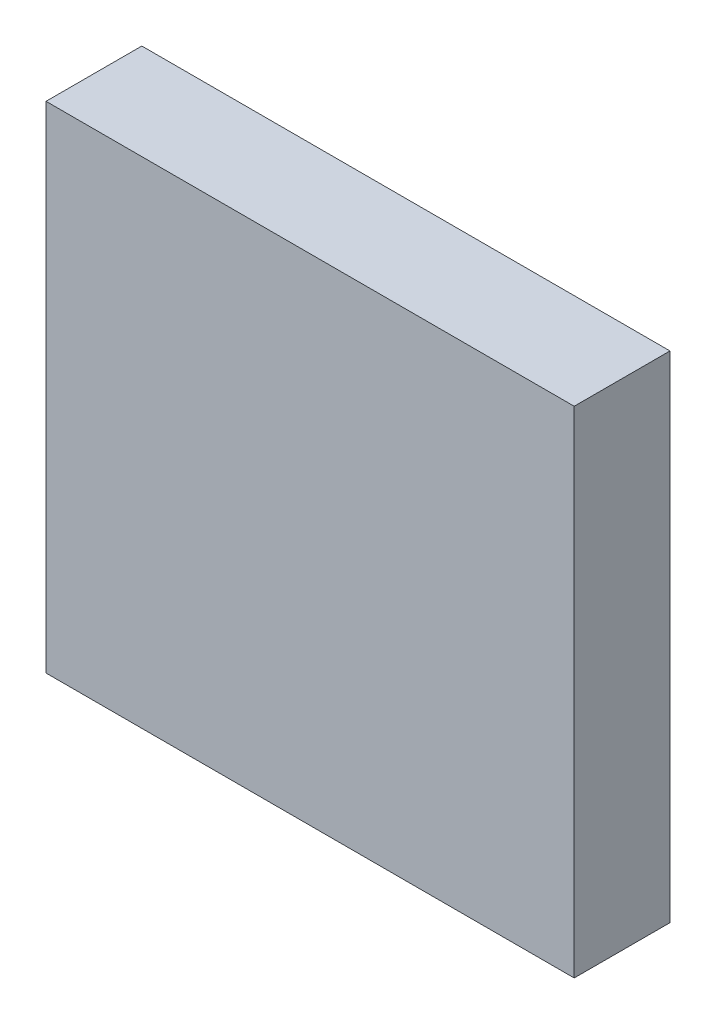
ISO-10303-21;
HEADER;
FILE_DESCRIPTION(('STEP AP214'),'2;1');
FILE_NAME('part.step','',(''),(''),'','','');
FILE_SCHEMA(('AUTOMOTIVE_DESIGN { 1 0 10303 214 1 1 1 1 }'));
ENDSEC;
DATA;
#1=APPLICATION_CONTEXT('core data for automotive mechanical design processes');
#2=APPLICATION_PROTOCOL_DEFINITION('international standard','automotive_design',2000,#1);
#3=PRODUCT_CONTEXT('',#1,'mechanical');
#4=PRODUCT('Part','Part','',(#3));
#5=PRODUCT_RELATED_PRODUCT_CATEGORY('part','',(#4));
#6=PRODUCT_DEFINITION_FORMATION('','',#4);
#7=PRODUCT_DEFINITION_CONTEXT('part definition',#1,'design');
#8=PRODUCT_DEFINITION('design','',#6,#7);
#9=PRODUCT_DEFINITION_SHAPE('','',#8);
#10=(LENGTH_UNIT() NAMED_UNIT(*) SI_UNIT(.MILLI.,.METRE.));
#11=(NAMED_UNIT(*) PLANE_ANGLE_UNIT() SI_UNIT($,.RADIAN.));
#12=(NAMED_UNIT(*) SI_UNIT($,.STERADIAN.) SOLID_ANGLE_UNIT());
#13=UNCERTAINTY_MEASURE_WITH_UNIT(LENGTH_MEASURE(1.E-05),#10,'distance_accuracy_value','');
#14=(GEOMETRIC_REPRESENTATION_CONTEXT(3) GLOBAL_UNCERTAINTY_ASSIGNED_CONTEXT((#13)) GLOBAL_UNIT_ASSIGNED_CONTEXT((#10,
#11,#12)) REPRESENTATION_CONTEXT('',''));
#15=CARTESIAN_POINT('',(0.,0.,0.));
#16=DIRECTION('',(0.,0.,1.));
#17=DIRECTION('',(1.,0.,0.));
#18=AXIS2_PLACEMENT_3D('',#15,#16,#17);
#19=CARTESIAN_POINT('',(0.,0.,17.41));
#20=DIRECTION('',(0.,1.,0.));
#21=DIRECTION('',(0.,0.,1.));
#22=AXIS2_PLACEMENT_3D('',#19,#20,#21);
#23=PLANE('',#22);
#24=DIRECTION('',(1.,0.,0.));
#25=VECTOR('',#24,1.);
#26=CARTESIAN_POINT('',(0.,0.,0.));
#27=LINE('',#26,#25);
#28=CARTESIAN_POINT('',(-96.,0.,0.));
#29=VERTEX_POINT('',#28);
#30=CARTESIAN_POINT('',(0.,0.,0.));
#31=VERTEX_POINT('',#30);
#32=EDGE_CURVE('E113',#29,#31,#27,.T.);
#33=ORIENTED_EDGE('',*,*,#32,.T.);
#34=DIRECTION('',(0.,0.,-1.));
#35=VECTOR('',#34,1.);
#36=CARTESIAN_POINT('',(0.,0.,17.41));
#37=LINE('',#36,#35);
#38=CARTESIAN_POINT('',(0.,0.,17.41));
#39=VERTEX_POINT('',#38);
#40=EDGE_CURVE('E11',#39,#31,#37,.T.);
#41=ORIENTED_EDGE('',*,*,#40,.F.);
#42=DIRECTION('',(1.,0.,0.));
#43=VECTOR('',#42,1.);
#44=CARTESIAN_POINT('',(0.,0.,17.41));
#45=LINE('',#44,#43);
#46=CARTESIAN_POINT('',(-96.,0.,17.41));
#47=VERTEX_POINT('',#46);
#48=EDGE_CURVE('E97',#47,#39,#45,.T.);
#49=ORIENTED_EDGE('',*,*,#48,.F.);
#50=DIRECTION('',(0.,0.,-1.));
#51=VECTOR('',#50,1.);
#52=CARTESIAN_POINT('',(-96.,0.,17.41));
#53=LINE('',#52,#51);
#54=EDGE_CURVE('E109',#47,#29,#53,.T.);
#55=ORIENTED_EDGE('',*,*,#54,.T.);
#56=EDGE_LOOP('',(#33,#41,#49,#55));
#57=FACE_BOUND('',#56,.T.);
#58=ADVANCED_FACE('F45',(#57),#23,.F.);
#59=CARTESIAN_POINT('',(0.,0.,17.41));
#60=DIRECTION('',(-1.,0.,0.));
#61=DIRECTION('',(0.,0.,1.));
#62=AXIS2_PLACEMENT_3D('',#59,#60,#61);
#63=PLANE('',#62);
#64=DIRECTION('',(0.,1.,0.));
#65=VECTOR('',#64,1.);
#66=CARTESIAN_POINT('',(0.,0.,0.));
#67=LINE('',#66,#65);
#68=CARTESIAN_POINT('',(0.,90.,0.));
#69=VERTEX_POINT('',#68);
#70=EDGE_CURVE('E102',#31,#69,#67,.T.);
#71=ORIENTED_EDGE('',*,*,#70,.T.);
#72=DIRECTION('',(0.,0.,-1.));
#73=VECTOR('',#72,1.);
#74=CARTESIAN_POINT('',(0.,90.,17.41));
#75=LINE('',#74,#73);
#76=CARTESIAN_POINT('',(0.,90.,17.41));
#77=VERTEX_POINT('',#76);
#78=EDGE_CURVE('E54',#77,#69,#75,.T.);
#79=ORIENTED_EDGE('',*,*,#78,.F.);
#80=DIRECTION('',(0.,1.,0.));
#81=VECTOR('',#80,1.);
#82=CARTESIAN_POINT('',(0.,0.,17.41));
#83=LINE('',#82,#81);
#84=EDGE_CURVE('E92',#39,#77,#83,.T.);
#85=ORIENTED_EDGE('',*,*,#84,.F.);
#86=ORIENTED_EDGE('',*,*,#40,.T.);
#87=EDGE_LOOP('',(#71,#79,#85,#86));
#88=FACE_BOUND('',#87,.T.);
#89=ADVANCED_FACE('F101',(#88),#63,.F.);
#90=CARTESIAN_POINT('',(0.,90.,17.41));
#91=DIRECTION('',(0.,-1.,0.));
#92=DIRECTION('',(0.,0.,-1.));
#93=AXIS2_PLACEMENT_3D('',#90,#91,#92);
#94=PLANE('',#93);
#95=DIRECTION('',(-1.,0.,0.));
#96=VECTOR('',#95,1.);
#97=CARTESIAN_POINT('',(0.,90.,0.));
#98=LINE('',#97,#96);
#99=CARTESIAN_POINT('',(-96.,90.,0.));
#100=VERTEX_POINT('',#99);
#101=EDGE_CURVE('E79',#69,#100,#98,.T.);
#102=ORIENTED_EDGE('',*,*,#101,.T.);
#103=DIRECTION('',(0.,0.,-1.));
#104=VECTOR('',#103,1.);
#105=CARTESIAN_POINT('',(-96.,90.,17.41));
#106=LINE('',#105,#104);
#107=CARTESIAN_POINT('',(-96.,90.,17.41));
#108=VERTEX_POINT('',#107);
#109=EDGE_CURVE('E104',#108,#100,#106,.T.);
#110=ORIENTED_EDGE('',*,*,#109,.F.);
#111=DIRECTION('',(-1.,0.,0.));
#112=VECTOR('',#111,1.);
#113=CARTESIAN_POINT('',(0.,90.,17.41));
#114=LINE('',#113,#112);
#115=EDGE_CURVE('E95',#77,#108,#114,.T.);
#116=ORIENTED_EDGE('',*,*,#115,.F.);
#117=ORIENTED_EDGE('',*,*,#78,.T.);
#118=EDGE_LOOP('',(#102,#110,#116,#117));
#119=FACE_BOUND('',#118,.T.);
#120=ADVANCED_FACE('F105',(#119),#94,.F.);
#121=CARTESIAN_POINT('',(-96.,0.,17.41));
#122=DIRECTION('',(1.,0.,0.));
#123=DIRECTION('',(0.,0.,-1.));
#124=AXIS2_PLACEMENT_3D('',#121,#122,#123);
#125=PLANE('',#124);
#126=DIRECTION('',(0.,-1.,0.));
#127=VECTOR('',#126,1.);
#128=CARTESIAN_POINT('',(-96.,0.,0.));
#129=LINE('',#128,#127);
#130=EDGE_CURVE('E85',#100,#29,#129,.T.);
#131=ORIENTED_EDGE('',*,*,#130,.T.);
#132=ORIENTED_EDGE('',*,*,#54,.F.);
#133=DIRECTION('',(0.,-1.,0.));
#134=VECTOR('',#133,1.);
#135=CARTESIAN_POINT('',(-96.,0.,17.41));
#136=LINE('',#135,#134);
#137=EDGE_CURVE('E62',#108,#47,#136,.T.);
#138=ORIENTED_EDGE('',*,*,#137,.F.);
#139=ORIENTED_EDGE('',*,*,#109,.T.);
#140=EDGE_LOOP('',(#131,#132,#138,#139));
#141=FACE_BOUND('',#140,.T.);
#142=ADVANCED_FACE('F126',(#141),#125,.F.);
#143=CARTESIAN_POINT('',(0.,0.,17.41));
#144=DIRECTION('',(0.,0.,-1.));
#145=DIRECTION('',(-1.,0.,0.));
#146=AXIS2_PLACEMENT_3D('',#143,#144,#145);
#147=PLANE('',#146);
#148=ORIENTED_EDGE('',*,*,#48,.T.);
#149=ORIENTED_EDGE('',*,*,#84,.T.);
#150=ORIENTED_EDGE('',*,*,#115,.T.);
#151=ORIENTED_EDGE('',*,*,#137,.T.);
#152=EDGE_LOOP('',(#148,#149,#150,#151));
#153=FACE_BOUND('',#152,.T.);
#154=ADVANCED_FACE('F93',(#153),#147,.F.);
#155=CARTESIAN_POINT('',(0.,0.,0.));
#156=DIRECTION('',(0.,0.,-1.));
#157=DIRECTION('',(-1.,0.,0.));
#158=AXIS2_PLACEMENT_3D('',#155,#156,#157);
#159=PLANE('',#158);
#160=ORIENTED_EDGE('',*,*,#32,.F.);
#161=ORIENTED_EDGE('',*,*,#130,.F.);
#162=ORIENTED_EDGE('',*,*,#101,.F.);
#163=ORIENTED_EDGE('',*,*,#70,.F.);
#164=EDGE_LOOP('',(#160,#161,#162,#163));
#165=FACE_BOUND('',#164,.T.);
#166=ADVANCED_FACE('F129',(#165),#159,.T.);
#167=CLOSED_SHELL('',(#58,#89,#120,#142,#154,#166));
#168=MANIFOLD_SOLID_BREP('B2',#167);
#169=ADVANCED_BREP_SHAPE_REPRESENTATION('',(#18,#168),#14);
#170=SHAPE_DEFINITION_REPRESENTATION(#9,#169);
ENDSEC;
END-ISO-10303-21;
